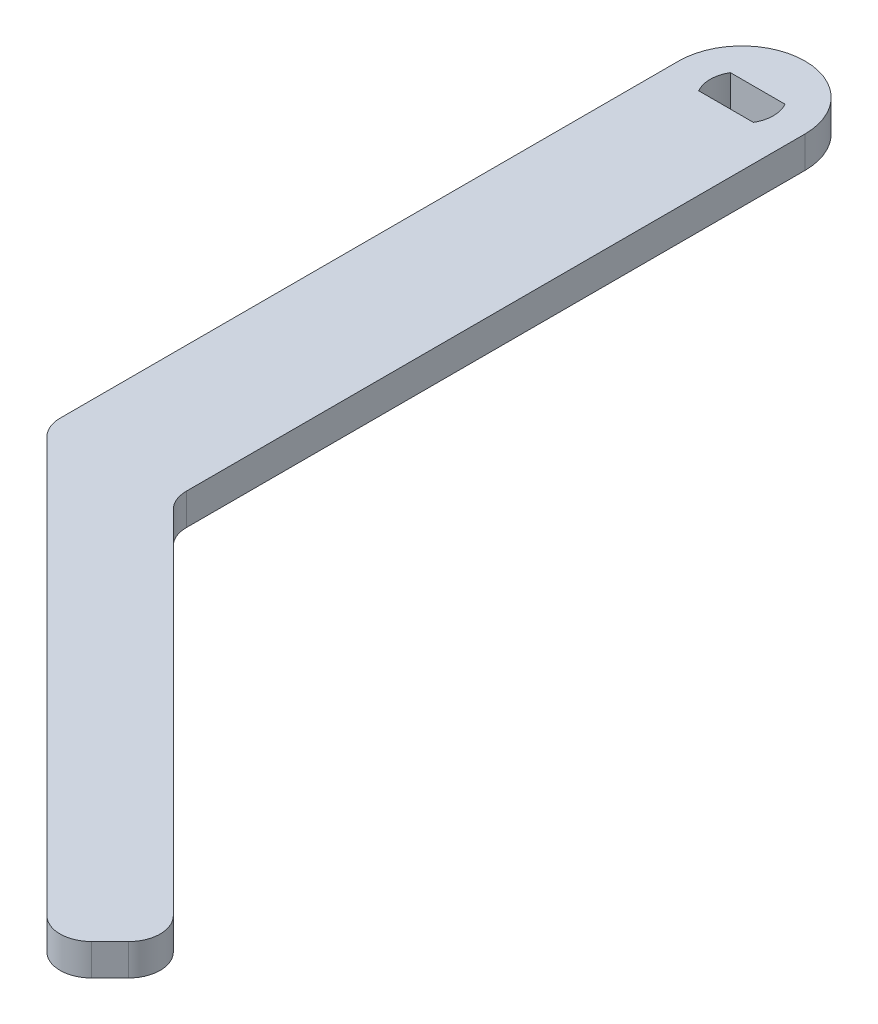
ISO-10303-21;
HEADER;
FILE_DESCRIPTION(('STEP AP214'),'2;1');
FILE_NAME('part.step','',(''),(''),'','','');
FILE_SCHEMA(('AUTOMOTIVE_DESIGN { 1 0 10303 214 1 1 1 1 }'));
ENDSEC;
DATA;
#1=APPLICATION_CONTEXT('core data for automotive mechanical design processes');
#2=APPLICATION_PROTOCOL_DEFINITION('international standard','automotive_design',2000,#1);
#3=PRODUCT_CONTEXT('',#1,'mechanical');
#4=PRODUCT('Part','Part','',(#3));
#5=PRODUCT_RELATED_PRODUCT_CATEGORY('part','',(#4));
#6=PRODUCT_DEFINITION_FORMATION('','',#4);
#7=PRODUCT_DEFINITION_CONTEXT('part definition',#1,'design');
#8=PRODUCT_DEFINITION('design','',#6,#7);
#9=PRODUCT_DEFINITION_SHAPE('','',#8);
#10=(LENGTH_UNIT() NAMED_UNIT(*) SI_UNIT(.MILLI.,.METRE.));
#11=(NAMED_UNIT(*) PLANE_ANGLE_UNIT() SI_UNIT($,.RADIAN.));
#12=(NAMED_UNIT(*) SI_UNIT($,.STERADIAN.) SOLID_ANGLE_UNIT());
#13=UNCERTAINTY_MEASURE_WITH_UNIT(LENGTH_MEASURE(1.E-05),#10,'distance_accuracy_value','');
#14=(GEOMETRIC_REPRESENTATION_CONTEXT(3) GLOBAL_UNCERTAINTY_ASSIGNED_CONTEXT((#13)) GLOBAL_UNIT_ASSIGNED_CONTEXT((#10,
#11,#12)) REPRESENTATION_CONTEXT('',''));
#15=CARTESIAN_POINT('',(0.,0.,0.));
#16=DIRECTION('',(0.,0.,1.));
#17=DIRECTION('',(1.,0.,0.));
#18=AXIS2_PLACEMENT_3D('',#15,#16,#17);
#19=CARTESIAN_POINT('',(0.,103.,0.));
#20=DIRECTION('',(0.,-1.,0.));
#21=DIRECTION('',(0.,0.,-1.));
#22=AXIS2_PLACEMENT_3D('',#19,#20,#21);
#23=PLANE('',#22);
#24=DIRECTION('',(0.707106781186549,0.,0.707106781186546));
#25=VECTOR('',#24,1.);
#26=CARTESIAN_POINT('',(-47.,103.,47.0000000000002));
#27=LINE('',#26,#25);
#28=CARTESIAN_POINT('',(-3.41421356237309,103.,90.5857864376269));
#29=VERTEX_POINT('',#28);
#30=CARTESIAN_POINT('',(22.8700576850889,103.,116.870057685089));
#31=VERTEX_POINT('',#30);
#32=EDGE_CURVE('E198',#29,#31,#27,.T.);
#33=ORIENTED_EDGE('',*,*,#32,.F.);
#34=CARTESIAN_POINT('',(-2.,103.,89.1715728752538));
#35=DIRECTION('',(0.,-1.,0.));
#36=DIRECTION('',(0.,0.,-1.));
#37=AXIS2_PLACEMENT_3D('',#34,#35,#36);
#38=CIRCLE('',#37,2.);
#39=CARTESIAN_POINT('',(-4.,103.,89.1715728752538));
#40=VERTEX_POINT('',#39);
#41=EDGE_CURVE('E264',#29,#40,#38,.T.);
#42=ORIENTED_EDGE('',*,*,#41,.T.);
#43=DIRECTION('',(0.,0.,1.));
#44=VECTOR('',#43,1.);
#45=CARTESIAN_POINT('',(-4.,103.,0.));
#46=LINE('',#45,#44);
#47=CARTESIAN_POINT('',(-4.,103.,50.));
#48=VERTEX_POINT('',#47);
#49=EDGE_CURVE('E192',#48,#40,#46,.T.);
#50=ORIENTED_EDGE('',*,*,#49,.F.);
#51=CARTESIAN_POINT('',(0.,103.,50.));
#52=DIRECTION('',(0.,-1.,0.));
#53=DIRECTION('',(0.,0.,-1.));
#54=AXIS2_PLACEMENT_3D('',#51,#52,#53);
#55=CIRCLE('',#54,4.);
#56=CARTESIAN_POINT('',(4.,103.,50.));
#57=VERTEX_POINT('',#56);
#58=EDGE_CURVE('E236',#48,#57,#55,.T.);
#59=ORIENTED_EDGE('',*,*,#58,.T.);
#60=DIRECTION('',(0.,0.,1.));
#61=VECTOR('',#60,1.);
#62=CARTESIAN_POINT('',(4.,103.,0.));
#63=LINE('',#62,#61);
#64=CARTESIAN_POINT('',(4.,103.,89.1715728752538));
#65=VERTEX_POINT('',#64);
#66=EDGE_CURVE('E218',#57,#65,#63,.T.);
#67=ORIENTED_EDGE('',*,*,#66,.T.);
#68=CARTESIAN_POINT('',(6.,103.,89.1715728752538));
#69=DIRECTION('',(0.,-1.,0.));
#70=DIRECTION('',(0.,0.,-1.));
#71=AXIS2_PLACEMENT_3D('',#68,#69,#70);
#72=CIRCLE('',#71,2.);
#73=CARTESIAN_POINT('',(4.5857864376269,103.,90.5857864376269));
#74=VERTEX_POINT('',#73);
#75=EDGE_CURVE('E51',#65,#74,#72,.F.);
#76=ORIENTED_EDGE('',*,*,#75,.T.);
#77=DIRECTION('',(0.707106781186549,0.,0.707106781186546));
#78=VECTOR('',#77,1.);
#79=CARTESIAN_POINT('',(-43.,103.,43.0000000000001));
#80=LINE('',#79,#78);
#81=CARTESIAN_POINT('',(26.8700576850888,103.,112.870057685089));
#82=VERTEX_POINT('',#81);
#83=EDGE_CURVE('E222',#74,#82,#80,.T.);
#84=ORIENTED_EDGE('',*,*,#83,.T.);
#85=CARTESIAN_POINT('',(25.4558441227157,103.,114.284271247462));
#86=DIRECTION('',(0.,-1.,0.));
#87=DIRECTION('',(0.,0.,-1.));
#88=AXIS2_PLACEMENT_3D('',#85,#86,#87);
#89=CIRCLE('',#88,2.);
#90=CARTESIAN_POINT('',(26.8700576850888,103.,115.698484809835));
#91=VERTEX_POINT('',#90);
#92=EDGE_CURVE('E261',#82,#91,#89,.T.);
#93=ORIENTED_EDGE('',*,*,#92,.T.);
#94=DIRECTION('',(0.707106781186546,0.,-0.707106781186549));
#95=VECTOR('',#94,1.);
#96=CARTESIAN_POINT('',(71.284271247462,103.,71.2842712474616));
#97=LINE('',#96,#95);
#98=CARTESIAN_POINT('',(25.6984848098351,103.,116.870057685089));
#99=VERTEX_POINT('',#98);
#100=EDGE_CURVE('E226',#99,#91,#97,.T.);
#101=ORIENTED_EDGE('',*,*,#100,.F.);
#102=CARTESIAN_POINT('',(24.2842712474619,103.,115.455844122716));
#103=DIRECTION('',(0.,-1.,0.));
#104=DIRECTION('',(0.,0.,-1.));
#105=AXIS2_PLACEMENT_3D('',#102,#103,#104);
#106=CIRCLE('',#105,2.);
#107=EDGE_CURVE('E258',#99,#31,#106,.T.);
#108=ORIENTED_EDGE('',*,*,#107,.T.);
#109=EDGE_LOOP('',(#33,#42,#50,#59,#67,#76,#84,#93,#101,#108));
#110=FACE_BOUND('',#109,.T.);
#111=CARTESIAN_POINT('',(0.,103.,50.));
#112=DIRECTION('',(0.,-1.,0.));
#113=DIRECTION('',(0.,0.,-1.));
#114=AXIS2_PLACEMENT_3D('',#111,#112,#113);
#115=CIRCLE('',#114,2.);
#116=CARTESIAN_POINT('',(-1.73205080756888,103.,51.));
#117=VERTEX_POINT('',#116);
#118=CARTESIAN_POINT('',(-1.73205080756888,103.,49.));
#119=VERTEX_POINT('',#118);
#120=EDGE_CURVE('E181',#117,#119,#115,.T.);
#121=ORIENTED_EDGE('',*,*,#120,.F.);
#122=DIRECTION('',(1.,0.,0.));
#123=VECTOR('',#122,1.);
#124=CARTESIAN_POINT('',(0.,103.,51.));
#125=LINE('',#124,#123);
#126=CARTESIAN_POINT('',(1.73205080756888,103.,51.));
#127=VERTEX_POINT('',#126);
#128=EDGE_CURVE('E184',#117,#127,#125,.T.);
#129=ORIENTED_EDGE('',*,*,#128,.T.);
#130=CARTESIAN_POINT('',(0.,103.,50.));
#131=DIRECTION('',(0.,-1.,0.));
#132=DIRECTION('',(0.,0.,-1.));
#133=AXIS2_PLACEMENT_3D('',#130,#131,#132);
#134=CIRCLE('',#133,2.);
#135=CARTESIAN_POINT('',(1.73205080756888,103.,49.));
#136=VERTEX_POINT('',#135);
#137=EDGE_CURVE('E172',#136,#127,#134,.T.);
#138=ORIENTED_EDGE('',*,*,#137,.F.);
#139=DIRECTION('',(-1.,0.,0.));
#140=VECTOR('',#139,1.);
#141=CARTESIAN_POINT('',(0.,103.,49.));
#142=LINE('',#141,#140);
#143=EDGE_CURVE('E149',#136,#119,#142,.T.);
#144=ORIENTED_EDGE('',*,*,#143,.T.);
#145=EDGE_LOOP('',(#121,#129,#138,#144));
#146=FACE_BOUND('',#145,.T.);
#147=ADVANCED_FACE('F42',(#110,#146),#23,.T.);
#148=CARTESIAN_POINT('',(0.,105.,50.));
#149=DIRECTION('',(0.,-1.,0.));
#150=DIRECTION('',(0.,0.,-1.));
#151=AXIS2_PLACEMENT_3D('',#148,#149,#150);
#152=PLANE('',#151);
#153=DIRECTION('',(0.,0.,1.));
#154=VECTOR('',#153,1.);
#155=CARTESIAN_POINT('',(4.,105.,0.));
#156=LINE('',#155,#154);
#157=CARTESIAN_POINT('',(4.,105.,50.));
#158=VERTEX_POINT('',#157);
#159=CARTESIAN_POINT('',(4.,105.,89.1715728752538));
#160=VERTEX_POINT('',#159);
#161=EDGE_CURVE('E197',#158,#160,#156,.T.);
#162=ORIENTED_EDGE('',*,*,#161,.F.);
#163=CARTESIAN_POINT('',(0.,105.,50.));
#164=DIRECTION('',(0.,1.,0.));
#165=DIRECTION('',(0.,0.,1.));
#166=AXIS2_PLACEMENT_3D('',#163,#164,#165);
#167=CIRCLE('',#166,4.);
#168=CARTESIAN_POINT('',(-4.,105.,50.));
#169=VERTEX_POINT('',#168);
#170=EDGE_CURVE('E188',#158,#169,#167,.T.);
#171=ORIENTED_EDGE('',*,*,#170,.T.);
#172=DIRECTION('',(0.,0.,1.));
#173=VECTOR('',#172,1.);
#174=CARTESIAN_POINT('',(-4.,105.,0.));
#175=LINE('',#174,#173);
#176=CARTESIAN_POINT('',(-4.,105.,89.1715728752538));
#177=VERTEX_POINT('',#176);
#178=EDGE_CURVE('E193',#169,#177,#175,.T.);
#179=ORIENTED_EDGE('',*,*,#178,.T.);
#180=CARTESIAN_POINT('',(-2.,105.,89.1715728752538));
#181=DIRECTION('',(0.,-1.,0.));
#182=DIRECTION('',(0.,0.,-1.));
#183=AXIS2_PLACEMENT_3D('',#180,#181,#182);
#184=CIRCLE('',#183,2.);
#185=CARTESIAN_POINT('',(-3.41421356237309,105.,90.5857864376269));
#186=VERTEX_POINT('',#185);
#187=EDGE_CURVE('E248',#177,#186,#184,.F.);
#188=ORIENTED_EDGE('',*,*,#187,.T.);
#189=DIRECTION('',(0.707106781186549,0.,0.707106781186546));
#190=VECTOR('',#189,1.);
#191=CARTESIAN_POINT('',(-47.,105.,47.0000000000002));
#192=LINE('',#191,#190);
#193=CARTESIAN_POINT('',(22.8700576850889,105.,116.870057685089));
#194=VERTEX_POINT('',#193);
#195=EDGE_CURVE('E210',#186,#194,#192,.T.);
#196=ORIENTED_EDGE('',*,*,#195,.T.);
#197=CARTESIAN_POINT('',(24.2842712474619,105.,115.455844122716));
#198=DIRECTION('',(0.,-1.,0.));
#199=DIRECTION('',(0.,0.,-1.));
#200=AXIS2_PLACEMENT_3D('',#197,#198,#199);
#201=CIRCLE('',#200,2.);
#202=CARTESIAN_POINT('',(25.6984848098351,105.,116.870057685089));
#203=VERTEX_POINT('',#202);
#204=EDGE_CURVE('E242',#194,#203,#201,.F.);
#205=ORIENTED_EDGE('',*,*,#204,.T.);
#206=DIRECTION('',(0.707106781186546,0.,-0.707106781186549));
#207=VECTOR('',#206,1.);
#208=CARTESIAN_POINT('',(71.284271247462,105.,71.2842712474616));
#209=LINE('',#208,#207);
#210=CARTESIAN_POINT('',(26.8700576850888,105.,115.698484809835));
#211=VERTEX_POINT('',#210);
#212=EDGE_CURVE('E206',#203,#211,#209,.T.);
#213=ORIENTED_EDGE('',*,*,#212,.T.);
#214=CARTESIAN_POINT('',(25.4558441227157,105.,114.284271247462));
#215=DIRECTION('',(0.,-1.,0.));
#216=DIRECTION('',(0.,0.,-1.));
#217=AXIS2_PLACEMENT_3D('',#214,#215,#216);
#218=CIRCLE('',#217,2.);
#219=CARTESIAN_POINT('',(26.8700576850888,105.,112.870057685089));
#220=VERTEX_POINT('',#219);
#221=EDGE_CURVE('E245',#211,#220,#218,.F.);
#222=ORIENTED_EDGE('',*,*,#221,.T.);
#223=DIRECTION('',(0.707106781186549,0.,0.707106781186546));
#224=VECTOR('',#223,1.);
#225=CARTESIAN_POINT('',(-43.,105.,43.0000000000001));
#226=LINE('',#225,#224);
#227=CARTESIAN_POINT('',(4.5857864376269,105.,90.5857864376269));
#228=VERTEX_POINT('',#227);
#229=EDGE_CURVE('E202',#228,#220,#226,.T.);
#230=ORIENTED_EDGE('',*,*,#229,.F.);
#231=CARTESIAN_POINT('',(6.,105.,89.1715728752538));
#232=DIRECTION('',(0.,-1.,0.));
#233=DIRECTION('',(0.,0.,-1.));
#234=AXIS2_PLACEMENT_3D('',#231,#232,#233);
#235=CIRCLE('',#234,2.);
#236=EDGE_CURVE('E11',#228,#160,#235,.T.);
#237=ORIENTED_EDGE('',*,*,#236,.T.);
#238=EDGE_LOOP('',(#162,#171,#179,#188,#196,#205,#213,#222,#230,#237));
#239=FACE_BOUND('',#238,.T.);
#240=DIRECTION('',(-1.,0.,0.));
#241=VECTOR('',#240,1.);
#242=CARTESIAN_POINT('',(0.,105.,51.));
#243=LINE('',#242,#241);
#244=CARTESIAN_POINT('',(1.73205080756888,105.,51.));
#245=VERTEX_POINT('',#244);
#246=CARTESIAN_POINT('',(-1.73205080756888,105.,51.));
#247=VERTEX_POINT('',#246);
#248=EDGE_CURVE('E66',#245,#247,#243,.T.);
#249=ORIENTED_EDGE('',*,*,#248,.T.);
#250=CARTESIAN_POINT('',(0.,105.,50.));
#251=DIRECTION('',(0.,1.,0.));
#252=DIRECTION('',(0.,0.,1.));
#253=AXIS2_PLACEMENT_3D('',#250,#251,#252);
#254=CIRCLE('',#253,2.);
#255=CARTESIAN_POINT('',(-1.73205080756888,105.,49.));
#256=VERTEX_POINT('',#255);
#257=EDGE_CURVE('E161',#256,#247,#254,.T.);
#258=ORIENTED_EDGE('',*,*,#257,.F.);
#259=DIRECTION('',(1.,0.,0.));
#260=VECTOR('',#259,1.);
#261=CARTESIAN_POINT('',(0.,105.,49.));
#262=LINE('',#261,#260);
#263=CARTESIAN_POINT('',(1.73205080756888,105.,49.));
#264=VERTEX_POINT('',#263);
#265=EDGE_CURVE('E146',#256,#264,#262,.T.);
#266=ORIENTED_EDGE('',*,*,#265,.T.);
#267=EDGE_CURVE('E156',#245,#264,#254,.T.);
#268=ORIENTED_EDGE('',*,*,#267,.F.);
#269=EDGE_LOOP('',(#249,#258,#266,#268));
#270=FACE_BOUND('',#269,.T.);
#271=ADVANCED_FACE('F162',(#239,#270),#152,.F.);
#272=CARTESIAN_POINT('',(6.,105.,89.1715728752538));
#273=DIRECTION('',(0.,1.,0.));
#274=DIRECTION('',(0.,0.,1.));
#275=AXIS2_PLACEMENT_3D('',#272,#273,#274);
#276=CYLINDRICAL_SURFACE('',#275,2.);
#277=ORIENTED_EDGE('',*,*,#236,.F.);
#278=DIRECTION('',(0.,-1.,0.));
#279=VECTOR('',#278,1.);
#280=CARTESIAN_POINT('',(4.58578643762691,105.,90.5857864376269));
#281=LINE('',#280,#279);
#282=EDGE_CURVE('E278',#74,#228,#281,.F.);
#283=ORIENTED_EDGE('',*,*,#282,.F.);
#284=ORIENTED_EDGE('',*,*,#75,.F.);
#285=DIRECTION('',(0.,-1.,0.));
#286=VECTOR('',#285,1.);
#287=CARTESIAN_POINT('',(4.,103.,89.1715728752538));
#288=LINE('',#287,#286);
#289=EDGE_CURVE('E270',#160,#65,#288,.T.);
#290=ORIENTED_EDGE('',*,*,#289,.F.);
#291=EDGE_LOOP('',(#277,#283,#284,#290));
#292=FACE_BOUND('',#291,.T.);
#293=ADVANCED_FACE('F301',(#292),#276,.F.);
#294=CARTESIAN_POINT('',(-43.,105.,43.0000000000001));
#295=DIRECTION('',(0.707106781186546,0.,-0.707106781186549));
#296=DIRECTION('',(-0.707106781186549,0.,-0.707106781186546));
#297=AXIS2_PLACEMENT_3D('',#294,#295,#296);
#298=PLANE('',#297);
#299=ORIENTED_EDGE('',*,*,#83,.F.);
#300=ORIENTED_EDGE('',*,*,#282,.T.);
#301=ORIENTED_EDGE('',*,*,#229,.T.);
#302=DIRECTION('',(0.,-1.,0.));
#303=VECTOR('',#302,1.);
#304=CARTESIAN_POINT('',(26.8700576850888,103.,112.870057685089));
#305=LINE('',#304,#303);
#306=EDGE_CURVE('E274',#220,#82,#305,.T.);
#307=ORIENTED_EDGE('',*,*,#306,.T.);
#308=EDGE_LOOP('',(#299,#300,#301,#307));
#309=FACE_BOUND('',#308,.T.);
#310=ADVANCED_FACE('F297',(#309),#298,.T.);
#311=CARTESIAN_POINT('',(25.4558441227157,105.,114.284271247462));
#312=DIRECTION('',(0.,1.,0.));
#313=DIRECTION('',(0.,0.,1.));
#314=AXIS2_PLACEMENT_3D('',#311,#312,#313);
#315=CYLINDRICAL_SURFACE('',#314,2.);
#316=ORIENTED_EDGE('',*,*,#221,.F.);
#317=DIRECTION('',(0.,-1.,0.));
#318=VECTOR('',#317,1.);
#319=CARTESIAN_POINT('',(26.8700576850888,105.,115.698484809835));
#320=LINE('',#319,#318);
#321=EDGE_CURVE('E285',#91,#211,#320,.F.);
#322=ORIENTED_EDGE('',*,*,#321,.F.);
#323=ORIENTED_EDGE('',*,*,#92,.F.);
#324=ORIENTED_EDGE('',*,*,#306,.F.);
#325=EDGE_LOOP('',(#316,#322,#323,#324));
#326=FACE_BOUND('',#325,.T.);
#327=ADVANCED_FACE('F332',(#326),#315,.T.);
#328=CARTESIAN_POINT('',(71.284271247462,105.,71.2842712474616));
#329=DIRECTION('',(-0.707106781186549,0.,-0.707106781186546));
#330=DIRECTION('',(-0.707106781186546,0.,0.707106781186549));
#331=AXIS2_PLACEMENT_3D('',#328,#329,#330);
#332=PLANE('',#331);
#333=ORIENTED_EDGE('',*,*,#100,.T.);
#334=ORIENTED_EDGE('',*,*,#321,.T.);
#335=ORIENTED_EDGE('',*,*,#212,.F.);
#336=DIRECTION('',(0.,-1.,0.));
#337=VECTOR('',#336,1.);
#338=CARTESIAN_POINT('',(25.6984848098351,105.,116.870057685089));
#339=LINE('',#338,#337);
#340=EDGE_CURVE('E281',#203,#99,#339,.T.);
#341=ORIENTED_EDGE('',*,*,#340,.T.);
#342=EDGE_LOOP('',(#333,#334,#335,#341));
#343=FACE_BOUND('',#342,.T.);
#344=ADVANCED_FACE('F328',(#343),#332,.F.);
#345=CARTESIAN_POINT('',(24.2842712474619,105.,115.455844122716));
#346=DIRECTION('',(0.,-1.,0.));
#347=DIRECTION('',(0.,0.,-1.));
#348=AXIS2_PLACEMENT_3D('',#345,#346,#347);
#349=CYLINDRICAL_SURFACE('',#348,2.);
#350=ORIENTED_EDGE('',*,*,#204,.F.);
#351=DIRECTION('',(0.,-1.,0.));
#352=VECTOR('',#351,1.);
#353=CARTESIAN_POINT('',(22.8700576850889,105.,116.870057685089));
#354=LINE('',#353,#352);
#355=EDGE_CURVE('E251',#31,#194,#354,.F.);
#356=ORIENTED_EDGE('',*,*,#355,.F.);
#357=ORIENTED_EDGE('',*,*,#107,.F.);
#358=ORIENTED_EDGE('',*,*,#340,.F.);
#359=EDGE_LOOP('',(#350,#356,#357,#358));
#360=FACE_BOUND('',#359,.T.);
#361=ADVANCED_FACE('F44',(#360),#349,.T.);
#362=CARTESIAN_POINT('',(-47.,105.,47.0000000000002));
#363=DIRECTION('',(0.707106781186546,0.,-0.707106781186549));
#364=DIRECTION('',(-0.707106781186549,0.,-0.707106781186546));
#365=AXIS2_PLACEMENT_3D('',#362,#363,#364);
#366=PLANE('',#365);
#367=ORIENTED_EDGE('',*,*,#195,.F.);
#368=DIRECTION('',(0.,-1.,0.));
#369=VECTOR('',#368,1.);
#370=CARTESIAN_POINT('',(-3.41421356237309,105.,90.5857864376269));
#371=LINE('',#370,#369);
#372=EDGE_CURVE('E254',#186,#29,#371,.T.);
#373=ORIENTED_EDGE('',*,*,#372,.T.);
#374=ORIENTED_EDGE('',*,*,#32,.T.);
#375=ORIENTED_EDGE('',*,*,#355,.T.);
#376=EDGE_LOOP('',(#367,#373,#374,#375));
#377=FACE_BOUND('',#376,.T.);
#378=ADVANCED_FACE('F319',(#377),#366,.F.);
#379=CARTESIAN_POINT('',(-2.,105.,89.1715728752538));
#380=DIRECTION('',(0.,-1.,0.));
#381=DIRECTION('',(0.,0.,-1.));
#382=AXIS2_PLACEMENT_3D('',#379,#380,#381);
#383=CYLINDRICAL_SURFACE('',#382,2.);
#384=ORIENTED_EDGE('',*,*,#187,.F.);
#385=DIRECTION('',(0.,-1.,0.));
#386=VECTOR('',#385,1.);
#387=CARTESIAN_POINT('',(-4.,105.,89.1715728752538));
#388=LINE('',#387,#386);
#389=EDGE_CURVE('E267',#40,#177,#388,.F.);
#390=ORIENTED_EDGE('',*,*,#389,.F.);
#391=ORIENTED_EDGE('',*,*,#41,.F.);
#392=ORIENTED_EDGE('',*,*,#372,.F.);
#393=EDGE_LOOP('',(#384,#390,#391,#392));
#394=FACE_BOUND('',#393,.T.);
#395=ADVANCED_FACE('F317',(#394),#383,.T.);
#396=CARTESIAN_POINT('',(4.,105.,0.));
#397=DIRECTION('',(1.,0.,0.));
#398=DIRECTION('',(0.,0.,-1.));
#399=AXIS2_PLACEMENT_3D('',#396,#397,#398);
#400=PLANE('',#399);
#401=DIRECTION('',(0.,-1.,0.));
#402=VECTOR('',#401,1.);
#403=CARTESIAN_POINT('',(4.,105.,50.));
#404=LINE('',#403,#402);
#405=EDGE_CURVE('E233',#158,#57,#404,.T.);
#406=ORIENTED_EDGE('',*,*,#405,.F.);
#407=ORIENTED_EDGE('',*,*,#161,.T.);
#408=ORIENTED_EDGE('',*,*,#289,.T.);
#409=ORIENTED_EDGE('',*,*,#66,.F.);
#410=EDGE_LOOP('',(#406,#407,#408,#409));
#411=FACE_BOUND('',#410,.T.);
#412=ADVANCED_FACE('F306',(#411),#400,.T.);
#413=CARTESIAN_POINT('',(-4.,105.,0.));
#414=DIRECTION('',(1.,0.,0.));
#415=DIRECTION('',(0.,0.,-1.));
#416=AXIS2_PLACEMENT_3D('',#413,#414,#415);
#417=PLANE('',#416);
#418=ORIENTED_EDGE('',*,*,#178,.F.);
#419=DIRECTION('',(0.,-1.,0.));
#420=VECTOR('',#419,1.);
#421=CARTESIAN_POINT('',(-4.,105.,50.));
#422=LINE('',#421,#420);
#423=EDGE_CURVE('E214',#169,#48,#422,.T.);
#424=ORIENTED_EDGE('',*,*,#423,.T.);
#425=ORIENTED_EDGE('',*,*,#49,.T.);
#426=ORIENTED_EDGE('',*,*,#389,.T.);
#427=EDGE_LOOP('',(#418,#424,#425,#426));
#428=FACE_BOUND('',#427,.T.);
#429=ADVANCED_FACE('F355',(#428),#417,.F.);
#430=CARTESIAN_POINT('',(0.,103.,50.));
#431=DIRECTION('',(0.,1.,0.));
#432=DIRECTION('',(0.,0.,1.));
#433=AXIS2_PLACEMENT_3D('',#430,#431,#432);
#434=CYLINDRICAL_SURFACE('',#433,4.);
#435=ORIENTED_EDGE('',*,*,#170,.F.);
#436=ORIENTED_EDGE('',*,*,#405,.T.);
#437=ORIENTED_EDGE('',*,*,#58,.F.);
#438=ORIENTED_EDGE('',*,*,#423,.F.);
#439=EDGE_LOOP('',(#435,#436,#437,#438));
#440=FACE_BOUND('',#439,.T.);
#441=ADVANCED_FACE('F309',(#440),#434,.T.);
#442=CARTESIAN_POINT('',(0.,75.,51.));
#443=DIRECTION('',(0.,0.,-1.));
#444=DIRECTION('',(-1.,0.,0.));
#445=AXIS2_PLACEMENT_3D('',#442,#443,#444);
#446=PLANE('',#445);
#447=DIRECTION('',(0.,1.,0.));
#448=VECTOR('',#447,1.);
#449=CARTESIAN_POINT('',(-1.73205080756888,75.,51.));
#450=LINE('',#449,#448);
#451=EDGE_CURVE('E169',#117,#247,#450,.T.);
#452=ORIENTED_EDGE('',*,*,#451,.T.);
#453=ORIENTED_EDGE('',*,*,#248,.F.);
#454=DIRECTION('',(0.,1.,0.));
#455=VECTOR('',#454,1.);
#456=CARTESIAN_POINT('',(1.73205080756888,75.,51.));
#457=LINE('',#456,#455);
#458=EDGE_CURVE('E153',#127,#245,#457,.T.);
#459=ORIENTED_EDGE('',*,*,#458,.F.);
#460=ORIENTED_EDGE('',*,*,#128,.F.);
#461=EDGE_LOOP('',(#452,#453,#459,#460));
#462=FACE_BOUND('',#461,.T.);
#463=ADVANCED_FACE('F354',(#462),#446,.T.);
#464=CARTESIAN_POINT('',(0.,75.,50.));
#465=DIRECTION('',(0.,1.,0.));
#466=DIRECTION('',(0.,0.,1.));
#467=AXIS2_PLACEMENT_3D('',#464,#465,#466);
#468=CYLINDRICAL_SURFACE('',#467,2.);
#469=ORIENTED_EDGE('',*,*,#120,.T.);
#470=DIRECTION('',(0.,1.,0.));
#471=VECTOR('',#470,1.);
#472=CARTESIAN_POINT('',(-1.73205080756888,75.,49.));
#473=LINE('',#472,#471);
#474=EDGE_CURVE('E152',#119,#256,#473,.T.);
#475=ORIENTED_EDGE('',*,*,#474,.T.);
#476=ORIENTED_EDGE('',*,*,#257,.T.);
#477=ORIENTED_EDGE('',*,*,#451,.F.);
#478=EDGE_LOOP('',(#469,#475,#476,#477));
#479=FACE_BOUND('',#478,.T.);
#480=ADVANCED_FACE('F448',(#479),#468,.F.);
#481=CARTESIAN_POINT('',(0.,75.,49.));
#482=DIRECTION('',(0.,0.,1.));
#483=DIRECTION('',(1.,0.,0.));
#484=AXIS2_PLACEMENT_3D('',#481,#482,#483);
#485=PLANE('',#484);
#486=DIRECTION('',(0.,1.,0.));
#487=VECTOR('',#486,1.);
#488=CARTESIAN_POINT('',(1.73205080756888,75.,49.));
#489=LINE('',#488,#487);
#490=EDGE_CURVE('E58',#136,#264,#489,.T.);
#491=ORIENTED_EDGE('',*,*,#490,.T.);
#492=ORIENTED_EDGE('',*,*,#265,.F.);
#493=ORIENTED_EDGE('',*,*,#474,.F.);
#494=ORIENTED_EDGE('',*,*,#143,.F.);
#495=EDGE_LOOP('',(#491,#492,#493,#494));
#496=FACE_BOUND('',#495,.T.);
#497=ADVANCED_FACE('F143',(#496),#485,.T.);
#498=ORIENTED_EDGE('',*,*,#137,.T.);
#499=ORIENTED_EDGE('',*,*,#458,.T.);
#500=ORIENTED_EDGE('',*,*,#267,.T.);
#501=ORIENTED_EDGE('',*,*,#490,.F.);
#502=EDGE_LOOP('',(#498,#499,#500,#501));
#503=FACE_BOUND('',#502,.T.);
#504=ADVANCED_FACE('F157',(#503),#468,.F.);
#505=CLOSED_SHELL('',(#147,#271,#293,#310,#327,#344,#361,#378,#395,#412,#429,#441,#463,#480,
#497,#504));
#506=MANIFOLD_SOLID_BREP('B2',#505);
#507=ADVANCED_BREP_SHAPE_REPRESENTATION('',(#18,#506),#14);
#508=SHAPE_DEFINITION_REPRESENTATION(#9,#507);
ENDSEC;
END-ISO-10303-21;
